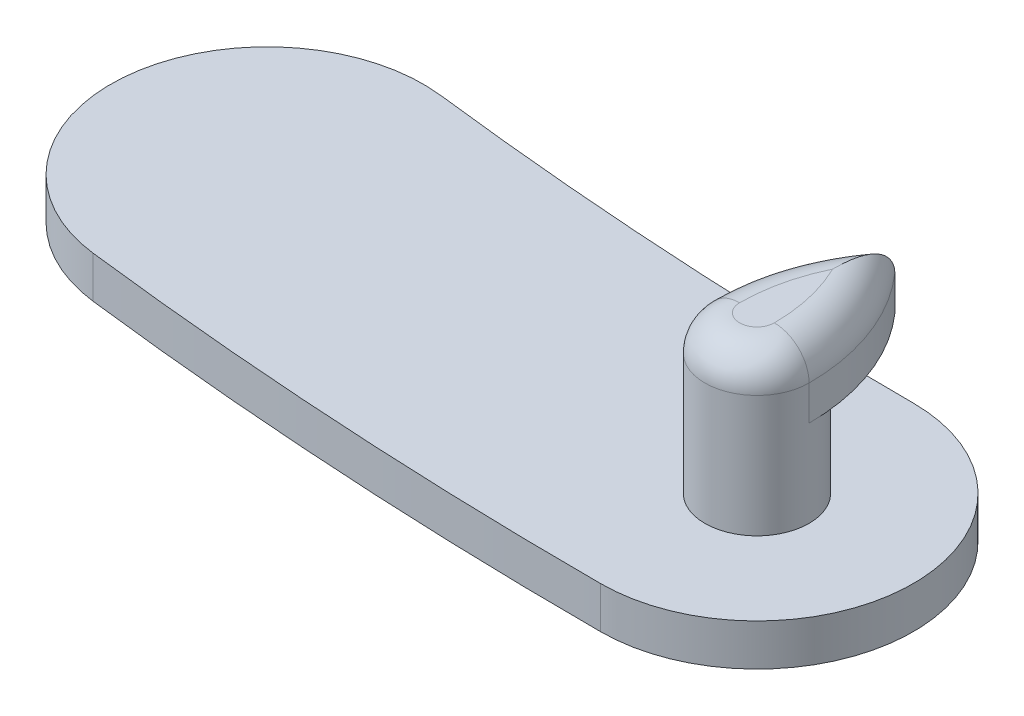
ISO-10303-21;
HEADER;
FILE_DESCRIPTION(('STEP AP214'),'2;1');
FILE_NAME('part.step','',(''),(''),'','','');
FILE_SCHEMA(('AUTOMOTIVE_DESIGN { 1 0 10303 214 1 1 1 1 }'));
ENDSEC;
DATA;
#1=APPLICATION_CONTEXT('core data for automotive mechanical design processes');
#2=APPLICATION_PROTOCOL_DEFINITION('international standard','automotive_design',2000,#1);
#3=PRODUCT_CONTEXT('',#1,'mechanical');
#4=PRODUCT('Part','Part','',(#3));
#5=PRODUCT_RELATED_PRODUCT_CATEGORY('part','',(#4));
#6=PRODUCT_DEFINITION_FORMATION('','',#4);
#7=PRODUCT_DEFINITION_CONTEXT('part definition',#1,'design');
#8=PRODUCT_DEFINITION('design','',#6,#7);
#9=PRODUCT_DEFINITION_SHAPE('','',#8);
#10=(LENGTH_UNIT() NAMED_UNIT(*) SI_UNIT(.MILLI.,.METRE.));
#11=(NAMED_UNIT(*) PLANE_ANGLE_UNIT() SI_UNIT($,.RADIAN.));
#12=(NAMED_UNIT(*) SI_UNIT($,.STERADIAN.) SOLID_ANGLE_UNIT());
#13=UNCERTAINTY_MEASURE_WITH_UNIT(LENGTH_MEASURE(1.E-05),#10,'distance_accuracy_value','');
#14=(GEOMETRIC_REPRESENTATION_CONTEXT(3) GLOBAL_UNCERTAINTY_ASSIGNED_CONTEXT((#13)) GLOBAL_UNIT_ASSIGNED_CONTEXT((#10,
#11,#12)) REPRESENTATION_CONTEXT('',''));
#15=CARTESIAN_POINT('',(0.,0.,0.));
#16=DIRECTION('',(0.,0.,1.));
#17=DIRECTION('',(1.,0.,0.));
#18=AXIS2_PLACEMENT_3D('',#15,#16,#17);
#19=CARTESIAN_POINT('',(5.715,1.524,-165.735));
#20=DIRECTION('',(0.,-1.,0.));
#21=DIRECTION('',(0.,0.,-1.));
#22=AXIS2_PLACEMENT_3D('',#19,#20,#21);
#23=CYLINDRICAL_SURFACE('',#22,165.1);
#24=CARTESIAN_POINT('',(5.715,0.,-165.735));
#25=DIRECTION('',(0.,1.,0.));
#26=DIRECTION('',(0.,0.,1.));
#27=AXIS2_PLACEMENT_3D('',#24,#25,#26);
#28=CIRCLE('',#27,165.1);
#29=CARTESIAN_POINT('',(-14.0180677290837,0.,-1.81850895044332));
#30=VERTEX_POINT('',#29);
#31=CARTESIAN_POINT('',(5.715,0.,-0.634999999999997));
#32=VERTEX_POINT('',#31);
#33=EDGE_CURVE('E127',#30,#32,#28,.T.);
#34=ORIENTED_EDGE('',*,*,#33,.T.);
#35=DIRECTION('',(0.,-1.,0.));
#36=VECTOR('',#35,1.);
#37=CARTESIAN_POINT('',(5.715,1.524,-0.634999999999997));
#38=LINE('',#37,#36);
#39=CARTESIAN_POINT('',(5.715,1.524,-0.634999999999997));
#40=VERTEX_POINT('',#39);
#41=EDGE_CURVE('E166',#40,#32,#38,.T.);
#42=ORIENTED_EDGE('',*,*,#41,.F.);
#43=CARTESIAN_POINT('',(5.715,1.524,-165.735));
#44=DIRECTION('',(0.,1.,0.));
#45=DIRECTION('',(0.,0.,1.));
#46=AXIS2_PLACEMENT_3D('',#43,#44,#45);
#47=CIRCLE('',#46,165.1);
#48=CARTESIAN_POINT('',(-14.0180677290837,1.524,-1.81850895044332));
#49=VERTEX_POINT('',#48);
#50=EDGE_CURVE('E139',#49,#40,#47,.T.);
#51=ORIENTED_EDGE('',*,*,#50,.F.);
#52=DIRECTION('',(0.,-1.,0.));
#53=VECTOR('',#52,1.);
#54=CARTESIAN_POINT('',(-14.0180677290837,1.524,-1.81850895044332));
#55=LINE('',#54,#53);
#56=EDGE_CURVE('E150',#49,#30,#55,.T.);
#57=ORIENTED_EDGE('',*,*,#56,.T.);
#58=EDGE_LOOP('',(#34,#42,#51,#57));
#59=FACE_BOUND('',#58,.T.);
#60=ADVANCED_FACE('F41',(#59),#23,.T.);
#61=CARTESIAN_POINT('',(5.715,1.524,-6.34999999999999));
#62=DIRECTION('',(0.,-1.,0.));
#63=DIRECTION('',(0.,0.,-1.));
#64=AXIS2_PLACEMENT_3D('',#61,#62,#63);
#65=CYLINDRICAL_SURFACE('',#64,5.715);
#66=CARTESIAN_POINT('',(5.715,0.,-6.34999999999999));
#67=DIRECTION('',(0.,1.,0.));
#68=DIRECTION('',(0.,0.,1.));
#69=AXIS2_PLACEMENT_3D('',#66,#67,#68);
#70=CIRCLE('',#69,5.715);
#71=CARTESIAN_POINT('',(5.715,0.,-12.065));
#72=VERTEX_POINT('',#71);
#73=EDGE_CURVE('E153',#32,#72,#70,.T.);
#74=ORIENTED_EDGE('',*,*,#73,.T.);
#75=DIRECTION('',(0.,-1.,0.));
#76=VECTOR('',#75,1.);
#77=CARTESIAN_POINT('',(5.715,1.524,-12.065));
#78=LINE('',#77,#76);
#79=CARTESIAN_POINT('',(5.715,1.524,-12.065));
#80=VERTEX_POINT('',#79);
#81=EDGE_CURVE('E164',#80,#72,#78,.T.);
#82=ORIENTED_EDGE('',*,*,#81,.F.);
#83=CARTESIAN_POINT('',(5.715,1.524,-6.34999999999999));
#84=DIRECTION('',(0.,1.,0.));
#85=DIRECTION('',(0.,0.,1.));
#86=AXIS2_PLACEMENT_3D('',#83,#84,#85);
#87=CIRCLE('',#86,5.715);
#88=EDGE_CURVE('E142',#40,#80,#87,.T.);
#89=ORIENTED_EDGE('',*,*,#88,.F.);
#90=ORIENTED_EDGE('',*,*,#41,.T.);
#91=EDGE_LOOP('',(#74,#82,#89,#90));
#92=FACE_BOUND('',#91,.T.);
#93=ADVANCED_FACE('F197',(#92),#65,.T.);
#94=CARTESIAN_POINT('',(5.715,1.524,-165.735));
#95=DIRECTION('',(0.,-1.,0.));
#96=DIRECTION('',(0.,0.,-1.));
#97=AXIS2_PLACEMENT_3D('',#94,#95,#96);
#98=CYLINDRICAL_SURFACE('',#97,153.67);
#99=CARTESIAN_POINT('',(5.715,0.,-165.735));
#100=DIRECTION('',(0.,1.,0.));
#101=DIRECTION('',(0.,0.,1.));
#102=AXIS2_PLACEMENT_3D('',#99,#100,#101);
#103=CIRCLE('',#102,153.67);
#104=CARTESIAN_POINT('',(-12.6519322709163,0.,-13.1665737154126));
#105=VERTEX_POINT('',#104);
#106=EDGE_CURVE('E156',#105,#72,#103,.T.);
#107=ORIENTED_EDGE('',*,*,#106,.F.);
#108=DIRECTION('',(0.,-1.,0.));
#109=VECTOR('',#108,1.);
#110=CARTESIAN_POINT('',(-12.6519322709163,1.524,-13.1665737154126));
#111=LINE('',#110,#109);
#112=CARTESIAN_POINT('',(-12.6519322709163,1.524,-13.1665737154126));
#113=VERTEX_POINT('',#112);
#114=EDGE_CURVE('E162',#113,#105,#111,.T.);
#115=ORIENTED_EDGE('',*,*,#114,.F.);
#116=CARTESIAN_POINT('',(5.715,1.524,-165.735));
#117=DIRECTION('',(0.,1.,0.));
#118=DIRECTION('',(0.,0.,1.));
#119=AXIS2_PLACEMENT_3D('',#116,#117,#118);
#120=CIRCLE('',#119,153.67);
#121=EDGE_CURVE('E145',#113,#80,#120,.T.);
#122=ORIENTED_EDGE('',*,*,#121,.T.);
#123=ORIENTED_EDGE('',*,*,#81,.T.);
#124=EDGE_LOOP('',(#107,#115,#122,#123));
#125=FACE_BOUND('',#124,.T.);
#126=ADVANCED_FACE('F202',(#125),#98,.F.);
#127=CARTESIAN_POINT('',(-13.335,1.524,-7.49254133292795));
#128=DIRECTION('',(0.,-1.,0.));
#129=DIRECTION('',(0.,0.,-1.));
#130=AXIS2_PLACEMENT_3D('',#127,#128,#129);
#131=CYLINDRICAL_SURFACE('',#130,5.715);
#132=CARTESIAN_POINT('',(-13.335,0.,-7.49254133292795));
#133=DIRECTION('',(0.,1.,0.));
#134=DIRECTION('',(0.,0.,1.));
#135=AXIS2_PLACEMENT_3D('',#132,#133,#134);
#136=CIRCLE('',#135,5.715);
#137=EDGE_CURVE('E143',#105,#30,#136,.T.);
#138=ORIENTED_EDGE('',*,*,#137,.T.);
#139=ORIENTED_EDGE('',*,*,#56,.F.);
#140=CARTESIAN_POINT('',(-13.335,1.524,-7.49254133292795));
#141=DIRECTION('',(0.,1.,0.));
#142=DIRECTION('',(0.,0.,1.));
#143=AXIS2_PLACEMENT_3D('',#140,#141,#142);
#144=CIRCLE('',#143,5.715);
#145=EDGE_CURVE('E148',#113,#49,#144,.T.);
#146=ORIENTED_EDGE('',*,*,#145,.F.);
#147=ORIENTED_EDGE('',*,*,#114,.T.);
#148=EDGE_LOOP('',(#138,#139,#146,#147));
#149=FACE_BOUND('',#148,.T.);
#150=ADVANCED_FACE('F208',(#149),#131,.T.);
#151=CARTESIAN_POINT('',(0.,1.524,0.));
#152=DIRECTION('',(0.,1.,0.));
#153=DIRECTION('',(0.,0.,1.));
#154=AXIS2_PLACEMENT_3D('',#151,#152,#153);
#155=PLANE('',#154);
#156=CARTESIAN_POINT('',(5.715,1.524,-6.35));
#157=DIRECTION('',(0.,1.,0.));
#158=DIRECTION('',(0.,0.,1.));
#159=AXIS2_PLACEMENT_3D('',#156,#157,#158);
#160=CIRCLE('',#159,1.905);
#161=CARTESIAN_POINT('',(5.715,1.524,-4.445));
#162=VERTEX_POINT('',#161);
#163=EDGE_CURVE('E128',#162,#162,#160,.T.);
#164=ORIENTED_EDGE('',*,*,#163,.F.);
#165=EDGE_LOOP('',(#164));
#166=FACE_BOUND('',#165,.T.);
#167=ORIENTED_EDGE('',*,*,#50,.T.);
#168=ORIENTED_EDGE('',*,*,#88,.T.);
#169=ORIENTED_EDGE('',*,*,#121,.F.);
#170=ORIENTED_EDGE('',*,*,#145,.T.);
#171=EDGE_LOOP('',(#167,#168,#169,#170));
#172=FACE_BOUND('',#171,.T.);
#173=ADVANCED_FACE('F212',(#166,#172),#155,.T.);
#174=CARTESIAN_POINT('',(0.,0.,0.));
#175=DIRECTION('',(0.,1.,0.));
#176=DIRECTION('',(0.,0.,1.));
#177=AXIS2_PLACEMENT_3D('',#174,#175,#176);
#178=PLANE('',#177);
#179=ORIENTED_EDGE('',*,*,#33,.F.);
#180=ORIENTED_EDGE('',*,*,#137,.F.);
#181=ORIENTED_EDGE('',*,*,#106,.T.);
#182=ORIENTED_EDGE('',*,*,#73,.F.);
#183=EDGE_LOOP('',(#179,#180,#181,#182));
#184=FACE_BOUND('',#183,.T.);
#185=ADVANCED_FACE('F214',(#184),#178,.F.);
#186=CARTESIAN_POINT('',(5.715,4.699,-6.35));
#187=DIRECTION('',(0.,-1.,0.));
#188=DIRECTION('',(0.,0.,-1.));
#189=AXIS2_PLACEMENT_3D('',#186,#187,#188);
#190=CYLINDRICAL_SURFACE('',#189,1.905);
#191=DIRECTION('',(0.,-1.,0.));
#192=VECTOR('',#191,1.);
#193=CARTESIAN_POINT('',(7.62,7.239,-6.35));
#194=LINE('',#193,#192);
#195=CARTESIAN_POINT('',(7.62,5.969,-6.35));
#196=VERTEX_POINT('',#195);
#197=CARTESIAN_POINT('',(7.62,4.699,-6.35));
#198=VERTEX_POINT('',#197);
#199=EDGE_CURVE('E109',#196,#198,#194,.T.);
#200=ORIENTED_EDGE('',*,*,#199,.F.);
#201=CARTESIAN_POINT('',(5.715,5.969,-6.35));
#202=DIRECTION('',(0.,-1.,0.));
#203=DIRECTION('',(0.,0.,-1.));
#204=AXIS2_PLACEMENT_3D('',#201,#202,#203);
#205=CIRCLE('',#204,1.905);
#206=CARTESIAN_POINT('',(3.81,5.969,-6.35));
#207=VERTEX_POINT('',#206);
#208=EDGE_CURVE('E50',#196,#207,#205,.T.);
#209=ORIENTED_EDGE('',*,*,#208,.T.);
#210=DIRECTION('',(0.,-1.,0.));
#211=VECTOR('',#210,1.);
#212=CARTESIAN_POINT('',(3.81,7.239,-6.35));
#213=LINE('',#212,#211);
#214=CARTESIAN_POINT('',(3.81,4.699,-6.35));
#215=VERTEX_POINT('',#214);
#216=EDGE_CURVE('E117',#207,#215,#213,.T.);
#217=ORIENTED_EDGE('',*,*,#216,.T.);
#218=CARTESIAN_POINT('',(5.715,4.699,-6.35));
#219=DIRECTION('',(0.,1.,0.));
#220=DIRECTION('',(0.,0.,1.));
#221=AXIS2_PLACEMENT_3D('',#218,#219,#220);
#222=CIRCLE('',#221,1.905);
#223=EDGE_CURVE('E121',#198,#215,#222,.T.);
#224=ORIENTED_EDGE('',*,*,#223,.F.);
#225=EDGE_LOOP('',(#200,#209,#217,#224));
#226=FACE_BOUND('',#225,.T.);
#227=ORIENTED_EDGE('',*,*,#163,.T.);
#228=EDGE_LOOP('',(#227));
#229=FACE_BOUND('',#228,.T.);
#230=ADVANCED_FACE('F122',(#226,#229),#190,.T.);
#231=CARTESIAN_POINT('',(11.43,7.239,-6.35));
#232=DIRECTION('',(0.,-1.,0.));
#233=DIRECTION('',(0.,0.,-1.));
#234=AXIS2_PLACEMENT_3D('',#231,#232,#233);
#235=CYLINDRICAL_SURFACE('',#234,7.62);
#236=ORIENTED_EDGE('',*,*,#216,.F.);
#237=CARTESIAN_POINT('',(11.43,5.969,-6.35));
#238=DIRECTION('',(0.,-1.,0.));
#239=DIRECTION('',(0.,0.,-1.));
#240=AXIS2_PLACEMENT_3D('',#237,#238,#239);
#241=CIRCLE('',#240,7.62);
#242=CARTESIAN_POINT('',(5.715,5.969,-11.390156247578));
#243=VERTEX_POINT('',#242);
#244=EDGE_CURVE('E176',#207,#243,#241,.T.);
#245=ORIENTED_EDGE('',*,*,#244,.T.);
#246=DIRECTION('',(0.,-1.,0.));
#247=VECTOR('',#246,1.);
#248=CARTESIAN_POINT('',(5.715,7.239,-11.390156247578));
#249=LINE('',#248,#247);
#250=CARTESIAN_POINT('',(5.715,4.699,-11.390156247578));
#251=VERTEX_POINT('',#250);
#252=EDGE_CURVE('E118',#243,#251,#249,.T.);
#253=ORIENTED_EDGE('',*,*,#252,.T.);
#254=CARTESIAN_POINT('',(11.43,4.699,-6.35));
#255=DIRECTION('',(0.,1.,0.));
#256=DIRECTION('',(0.,0.,-1.));
#257=AXIS2_PLACEMENT_3D('',#254,#255,#256);
#258=CIRCLE('',#257,7.62);
#259=EDGE_CURVE('E131',#251,#215,#258,.T.);
#260=ORIENTED_EDGE('',*,*,#259,.T.);
#261=EDGE_LOOP('',(#236,#245,#253,#260));
#262=FACE_BOUND('',#261,.T.);
#263=ADVANCED_FACE('F223',(#262),#235,.T.);
#264=CARTESIAN_POINT('',(0.,7.239,-6.35));
#265=DIRECTION('',(0.,-1.,0.));
#266=DIRECTION('',(0.,0.,-1.));
#267=AXIS2_PLACEMENT_3D('',#264,#265,#266);
#268=CYLINDRICAL_SURFACE('',#267,7.62);
#269=ORIENTED_EDGE('',*,*,#252,.F.);
#270=CARTESIAN_POINT('',(0.,5.969,-6.35));
#271=DIRECTION('',(0.,-1.,0.));
#272=DIRECTION('',(0.,0.,-1.));
#273=AXIS2_PLACEMENT_3D('',#270,#271,#272);
#274=CIRCLE('',#273,7.62);
#275=EDGE_CURVE('E11',#243,#196,#274,.T.);
#276=ORIENTED_EDGE('',*,*,#275,.T.);
#277=ORIENTED_EDGE('',*,*,#199,.T.);
#278=CARTESIAN_POINT('',(0.,4.699,-6.35));
#279=DIRECTION('',(0.,1.,0.));
#280=DIRECTION('',(0.,0.,1.));
#281=AXIS2_PLACEMENT_3D('',#278,#279,#280);
#282=CIRCLE('',#281,7.62);
#283=EDGE_CURVE('E113',#198,#251,#282,.T.);
#284=ORIENTED_EDGE('',*,*,#283,.T.);
#285=EDGE_LOOP('',(#269,#276,#277,#284));
#286=FACE_BOUND('',#285,.T.);
#287=ADVANCED_FACE('F111',(#286),#268,.T.);
#288=CARTESIAN_POINT('',(5.715,7.239,-6.35));
#289=DIRECTION('',(0.,-1.,0.));
#290=DIRECTION('',(0.,0.,-1.));
#291=AXIS2_PLACEMENT_3D('',#288,#289,#290);
#292=PLANE('',#291);
#293=CARTESIAN_POINT('',(0.,7.239,-6.35));
#294=DIRECTION('',(0.,-1.,0.));
#295=DIRECTION('',(0.,0.,-1.));
#296=AXIS2_PLACEMENT_3D('',#293,#294,#295);
#297=CIRCLE('',#296,6.35);
#298=CARTESIAN_POINT('',(6.35,7.239,-6.35));
#299=VERTEX_POINT('',#298);
#300=CARTESIAN_POINT('',(5.715,7.239,-9.11790082914833));
#301=VERTEX_POINT('',#300);
#302=EDGE_CURVE('E169',#299,#301,#297,.F.);
#303=ORIENTED_EDGE('',*,*,#302,.T.);
#304=CARTESIAN_POINT('',(11.43,7.239,-6.35));
#305=DIRECTION('',(0.,-1.,0.));
#306=DIRECTION('',(0.,0.,-1.));
#307=AXIS2_PLACEMENT_3D('',#304,#305,#306);
#308=CIRCLE('',#307,6.35);
#309=CARTESIAN_POINT('',(5.08,7.239,-6.35));
#310=VERTEX_POINT('',#309);
#311=EDGE_CURVE('E173',#301,#310,#308,.F.);
#312=ORIENTED_EDGE('',*,*,#311,.T.);
#313=CARTESIAN_POINT('',(5.715,7.239,-6.35));
#314=DIRECTION('',(0.,-1.,0.));
#315=DIRECTION('',(0.,0.,-1.));
#316=AXIS2_PLACEMENT_3D('',#313,#314,#315);
#317=CIRCLE('',#316,0.634999999999998);
#318=EDGE_CURVE('E171',#310,#299,#317,.F.);
#319=ORIENTED_EDGE('',*,*,#318,.T.);
#320=EDGE_LOOP('',(#303,#312,#319));
#321=FACE_BOUND('',#320,.T.);
#322=ADVANCED_FACE('F229',(#321),#292,.F.);
#323=CARTESIAN_POINT('',(5.715,4.699,-6.35));
#324=DIRECTION('',(0.,-1.,0.));
#325=DIRECTION('',(0.,0.,-1.));
#326=AXIS2_PLACEMENT_3D('',#323,#324,#325);
#327=PLANE('',#326);
#328=ORIENTED_EDGE('',*,*,#283,.F.);
#329=ORIENTED_EDGE('',*,*,#223,.T.);
#330=ORIENTED_EDGE('',*,*,#259,.F.);
#331=EDGE_LOOP('',(#328,#329,#330));
#332=FACE_BOUND('',#331,.T.);
#333=ADVANCED_FACE('F130',(#332),#327,.T.);
#334=CARTESIAN_POINT('',(0.,5.969,-6.35));
#335=DIRECTION('',(0.,-1.,0.));
#336=DIRECTION('',(0.,0.,-1.));
#337=AXIS2_PLACEMENT_3D('',#334,#335,#336);
#338=TOROIDAL_SURFACE('',#337,6.35,1.27);
#339=CARTESIAN_POINT('',(5.715,5.969,-11.390156247578));
#340=CARTESIAN_POINT('',(5.715,5.99595226894784,-11.3901612255222));
#341=CARTESIAN_POINT('',(5.715,6.02288756332556,-11.3888579334594));
#342=CARTESIAN_POINT('',(5.715,6.07649130506096,-11.383694350311));
#343=CARTESIAN_POINT('',(5.715,6.1031599442456,-11.379836055317));
#344=CARTESIAN_POINT('',(5.715,6.18197040966107,-11.3646132185749));
#345=CARTESIAN_POINT('',(5.715,6.23344424812944,-11.3495981034861));
#346=CARTESIAN_POINT('',(5.715,6.33281631027844,-11.3109885166619));
#347=CARTESIAN_POINT('',(5.715,6.3807238382468,-11.2874173852917));
#348=CARTESIAN_POINT('',(5.715,6.4723737492063,-11.2331124977005));
#349=CARTESIAN_POINT('',(5.715,6.51610649500352,-11.202362707718));
#350=CARTESIAN_POINT('',(5.715,6.61594799857841,-11.1213665169513));
#351=CARTESIAN_POINT('',(5.715,6.66976294784088,-11.0682995725617));
#352=CARTESIAN_POINT('',(5.715,6.76824147839714,-10.9543089121104));
#353=CARTESIAN_POINT('',(5.715,6.81288781180163,-10.8933707331471));
#354=CARTESIAN_POINT('',(5.715,6.91501609738003,-10.7327724115525));
#355=CARTESIAN_POINT('',(5.715,6.96691875164713,-10.629588493659));
#356=CARTESIAN_POINT('',(5.715,7.05452001811034,-10.4166282045616));
#357=CARTESIAN_POINT('',(5.715,7.09018151150394,-10.30683737479));
#358=CARTESIAN_POINT('',(5.715,7.14201427747044,-10.1083841363291));
#359=CARTESIAN_POINT('',(5.715,7.16074396975065,-10.0203632267488));
#360=CARTESIAN_POINT('',(5.715,7.19151283361104,-9.8431411461686));
#361=CARTESIAN_POINT('',(5.715,7.20354811969612,-9.75393932043729));
#362=CARTESIAN_POINT('',(5.71500000000001,7.23132514459101,-9.48563723719671));
#363=CARTESIAN_POINT('',(5.71500000000006,7.23877898378391,-9.30566261947835));
#364=CARTESIAN_POINT('',(5.715,7.23899837154812,-9.12326510545392));
#365=CARTESIAN_POINT('',(5.715,7.2389999855263,-9.12058293604765));
#366=CARTESIAN_POINT('',(5.715,7.239,-9.11790082914833));
#367=B_SPLINE_CURVE_WITH_KNOTS('',3,(#339,#340,#341,#342,#343,#344,#345,#346,#347,#348,#349,
#350,#351,#352,#353,#354,#355,#356,#357,#358,#359,#360,#361,#362,#363,#364,#365,#366),
.UNSPECIFIED.,.F.,.F.,(4,2,2,2,2,2,2,2,2,2,2,2,2,4),(0.,0.0807931690112934,0.161523292849441,
0.321426588666171,0.480896915144104,0.640726890196131,0.866199294228723,1.09209204535423,
1.43666041440091,1.78201238260329,2.05169455730533,2.32153309513316,2.86066712474436,
2.86871362968708),.UNSPECIFIED.);
#368=EDGE_CURVE('E64',#301,#243,#367,.F.);
#369=ORIENTED_EDGE('',*,*,#368,.F.);
#370=ORIENTED_EDGE('',*,*,#302,.F.);
#371=CARTESIAN_POINT('',(6.35,5.969,-6.35));
#372=DIRECTION('',(0.,0.,1.));
#373=DIRECTION('',(0.,-1.,0.));
#374=AXIS2_PLACEMENT_3D('',#371,#372,#373);
#375=CIRCLE('',#374,1.27);
#376=EDGE_CURVE('E45',#196,#299,#375,.T.);
#377=ORIENTED_EDGE('',*,*,#376,.F.);
#378=ORIENTED_EDGE('',*,*,#275,.F.);
#379=EDGE_LOOP('',(#369,#370,#377,#378));
#380=FACE_BOUND('',#379,.T.);
#381=ADVANCED_FACE('F186',(#380),#338,.T.);
#382=CARTESIAN_POINT('',(5.715,5.969,-6.35));
#383=DIRECTION('',(0.,-1.,0.));
#384=DIRECTION('',(0.,0.,-1.));
#385=AXIS2_PLACEMENT_3D('',#382,#383,#384);
#386=DEGENERATE_TOROIDAL_SURFACE('',#385,0.634999999999998,1.27,.T.);
#387=ORIENTED_EDGE('',*,*,#376,.T.);
#388=ORIENTED_EDGE('',*,*,#318,.F.);
#389=CARTESIAN_POINT('',(5.08,5.969,-6.35));
#390=DIRECTION('',(0.,0.,-1.));
#391=DIRECTION('',(0.,1.,0.));
#392=AXIS2_PLACEMENT_3D('',#389,#390,#391);
#393=CIRCLE('',#392,1.27);
#394=EDGE_CURVE('E180',#207,#310,#393,.T.);
#395=ORIENTED_EDGE('',*,*,#394,.F.);
#396=ORIENTED_EDGE('',*,*,#208,.F.);
#397=EDGE_LOOP('',(#387,#388,#395,#396));
#398=FACE_BOUND('',#397,.T.);
#399=ADVANCED_FACE('F43',(#398),#386,.T.);
#400=CARTESIAN_POINT('',(11.43,5.969,-6.35));
#401=DIRECTION('',(0.,-1.,0.));
#402=DIRECTION('',(0.,0.,-1.));
#403=AXIS2_PLACEMENT_3D('',#400,#401,#402);
#404=TOROIDAL_SURFACE('',#403,6.35,1.27);
#405=ORIENTED_EDGE('',*,*,#368,.T.);
#406=ORIENTED_EDGE('',*,*,#244,.F.);
#407=ORIENTED_EDGE('',*,*,#394,.T.);
#408=ORIENTED_EDGE('',*,*,#311,.F.);
#409=EDGE_LOOP('',(#405,#406,#407,#408));
#410=FACE_BOUND('',#409,.T.);
#411=ADVANCED_FACE('F189',(#410),#404,.T.);
#412=CLOSED_SHELL('',(#60,#93,#126,#150,#173,#185,#230,#263,#287,#322,#333,#381,#399,#411));
#413=MANIFOLD_SOLID_BREP('B2',#412);
#414=ADVANCED_BREP_SHAPE_REPRESENTATION('',(#18,#413),#14);
#415=SHAPE_DEFINITION_REPRESENTATION(#9,#414);
ENDSEC;
END-ISO-10303-21;
